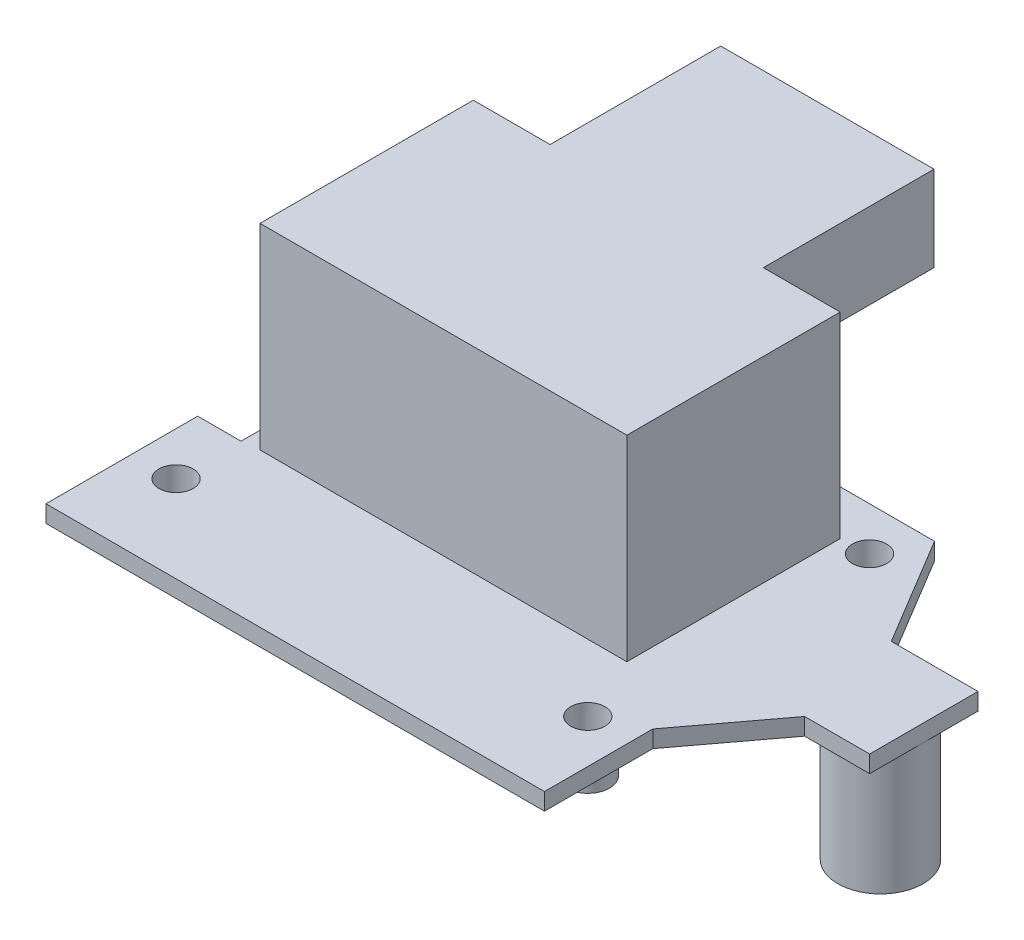
ISO-10303-21;
HEADER;
FILE_DESCRIPTION(('STEP AP214'),'2;1');
FILE_NAME('part.step','',(''),(''),'','','');
FILE_SCHEMA(('AUTOMOTIVE_DESIGN { 1 0 10303 214 1 1 1 1 }'));
ENDSEC;
DATA;
#1=APPLICATION_CONTEXT('core data for automotive mechanical design processes');
#2=APPLICATION_PROTOCOL_DEFINITION('international standard','automotive_design',2000,#1);
#3=PRODUCT_CONTEXT('',#1,'mechanical');
#4=PRODUCT('Part','Part','',(#3));
#5=PRODUCT_RELATED_PRODUCT_CATEGORY('part','',(#4));
#6=PRODUCT_DEFINITION_FORMATION('','',#4);
#7=PRODUCT_DEFINITION_CONTEXT('part definition',#1,'design');
#8=PRODUCT_DEFINITION('design','',#6,#7);
#9=PRODUCT_DEFINITION_SHAPE('','',#8);
#10=(LENGTH_UNIT() NAMED_UNIT(*) SI_UNIT(.MILLI.,.METRE.));
#11=(NAMED_UNIT(*) PLANE_ANGLE_UNIT() SI_UNIT($,.RADIAN.));
#12=(NAMED_UNIT(*) SI_UNIT($,.STERADIAN.) SOLID_ANGLE_UNIT());
#13=UNCERTAINTY_MEASURE_WITH_UNIT(LENGTH_MEASURE(1.E-05),#10,'distance_accuracy_value','');
#14=(GEOMETRIC_REPRESENTATION_CONTEXT(3) GLOBAL_UNCERTAINTY_ASSIGNED_CONTEXT((#13)) GLOBAL_UNIT_ASSIGNED_CONTEXT((#10,
#11,#12)) REPRESENTATION_CONTEXT('',''));
#15=CARTESIAN_POINT('',(0.,0.,0.));
#16=DIRECTION('',(0.,0.,1.));
#17=DIRECTION('',(1.,0.,0.));
#18=AXIS2_PLACEMENT_3D('',#15,#16,#17);
#19=CARTESIAN_POINT('',(7.08,25.,-43.));
#20=DIRECTION('',(0.,0.,-1.));
#21=DIRECTION('',(-1.,0.,0.));
#22=AXIS2_PLACEMENT_3D('',#19,#20,#21);
#23=PLANE('',#22);
#24=DIRECTION('',(1.,0.,0.));
#25=VECTOR('',#24,1.);
#26=CARTESIAN_POINT('',(7.08,25.,-43.));
#27=LINE('',#26,#25);
#28=CARTESIAN_POINT('',(7.08,25.,-43.));
#29=VERTEX_POINT('',#28);
#30=CARTESIAN_POINT('',(16.08,25.,-43.));
#31=VERTEX_POINT('',#30);
#32=EDGE_CURVE('E233',#29,#31,#27,.T.);
#33=ORIENTED_EDGE('',*,*,#32,.T.);
#34=DIRECTION('',(0.,1.,0.));
#35=VECTOR('',#34,1.);
#36=CARTESIAN_POINT('',(16.08,25.,-43.));
#37=LINE('',#36,#35);
#38=CARTESIAN_POINT('',(16.08,15.,-43.));
#39=VERTEX_POINT('',#38);
#40=EDGE_CURVE('E52',#39,#31,#37,.T.);
#41=ORIENTED_EDGE('',*,*,#40,.F.);
#42=DIRECTION('',(-1.,0.,0.));
#43=VECTOR('',#42,1.);
#44=CARTESIAN_POINT('',(16.08,15.,-43.));
#45=LINE('',#44,#43);
#46=CARTESIAN_POINT('',(41.08,15.,-43.));
#47=VERTEX_POINT('',#46);
#48=EDGE_CURVE('E47',#47,#39,#45,.T.);
#49=ORIENTED_EDGE('',*,*,#48,.F.);
#50=DIRECTION('',(0.,-1.,0.));
#51=VECTOR('',#50,1.);
#52=CARTESIAN_POINT('',(41.08,25.,-43.));
#53=LINE('',#52,#51);
#54=CARTESIAN_POINT('',(41.08,25.,-43.));
#55=VERTEX_POINT('',#54);
#56=EDGE_CURVE('E705',#55,#47,#53,.T.);
#57=ORIENTED_EDGE('',*,*,#56,.F.);
#58=CARTESIAN_POINT('',(50.08,25.,-43.));
#59=VERTEX_POINT('',#58);
#60=EDGE_CURVE('E232',#55,#59,#27,.T.);
#61=ORIENTED_EDGE('',*,*,#60,.T.);
#62=DIRECTION('',(0.,-1.,0.));
#63=VECTOR('',#62,1.);
#64=CARTESIAN_POINT('',(50.08,25.,-43.));
#65=LINE('',#64,#63);
#66=CARTESIAN_POINT('',(50.08,2.,-43.));
#67=VERTEX_POINT('',#66);
#68=EDGE_CURVE('E247',#59,#67,#65,.T.);
#69=ORIENTED_EDGE('',*,*,#68,.T.);
#70=DIRECTION('',(1.,0.,0.));
#71=VECTOR('',#70,1.);
#72=CARTESIAN_POINT('',(7.08,2.,-43.));
#73=LINE('',#72,#71);
#74=CARTESIAN_POINT('',(7.08,2.,-43.));
#75=VERTEX_POINT('',#74);
#76=EDGE_CURVE('E227',#75,#67,#73,.T.);
#77=ORIENTED_EDGE('',*,*,#76,.F.);
#78=DIRECTION('',(0.,-1.,0.));
#79=VECTOR('',#78,1.);
#80=CARTESIAN_POINT('',(7.08,25.,-43.));
#81=LINE('',#80,#79);
#82=EDGE_CURVE('E235',#29,#75,#81,.T.);
#83=ORIENTED_EDGE('',*,*,#82,.F.);
#84=EDGE_LOOP('',(#33,#41,#49,#57,#61,#69,#77,#83));
#85=FACE_BOUND('',#84,.T.);
#86=ADVANCED_FACE('F32',(#85),#23,.T.);
#87=CARTESIAN_POINT('',(0.,0.,0.));
#88=DIRECTION('',(0.,-1.,0.));
#89=DIRECTION('',(0.,0.,-1.));
#90=AXIS2_PLACEMENT_3D('',#87,#88,#89);
#91=PLANE('',#90);
#92=CARTESIAN_POINT('',(53.34,0.,-10.16));
#93=DIRECTION('',(0.,-1.,0.));
#94=DIRECTION('',(0.,0.,-1.));
#95=AXIS2_PLACEMENT_3D('',#92,#93,#94);
#96=CIRCLE('',#95,2.555);
#97=CARTESIAN_POINT('',(53.34,0.,-12.715));
#98=VERTEX_POINT('',#97);
#99=EDGE_CURVE('E202',#98,#98,#96,.T.);
#100=ORIENTED_EDGE('',*,*,#99,.F.);
#101=EDGE_LOOP('',(#100));
#102=FACE_BOUND('',#101,.T.);
#103=DIRECTION('',(0.,0.,1.));
#104=VECTOR('',#103,1.);
#105=CARTESIAN_POINT('',(0.,0.,0.));
#106=LINE('',#105,#104);
#107=CARTESIAN_POINT('',(0.,0.,-17.78));
#108=VERTEX_POINT('',#107);
#109=CARTESIAN_POINT('',(0.,0.,0.));
#110=VERTEX_POINT('',#109);
#111=EDGE_CURVE('E263',#108,#110,#106,.T.);
#112=ORIENTED_EDGE('',*,*,#111,.F.);
#113=DIRECTION('',(-1.,0.,0.));
#114=VECTOR('',#113,1.);
#115=CARTESIAN_POINT('',(0.,0.,-17.78));
#116=LINE('',#115,#114);
#117=CARTESIAN_POINT('',(5.08,0.,-17.78));
#118=VERTEX_POINT('',#117);
#119=EDGE_CURVE('E268',#118,#108,#116,.T.);
#120=ORIENTED_EDGE('',*,*,#119,.F.);
#121=DIRECTION('',(0.,0.,1.));
#122=VECTOR('',#121,1.);
#123=CARTESIAN_POINT('',(5.08,0.,-48.26));
#124=LINE('',#123,#122);
#125=CARTESIAN_POINT('',(5.08,0.,-48.26));
#126=VERTEX_POINT('',#125);
#127=EDGE_CURVE('E307',#126,#118,#124,.T.);
#128=ORIENTED_EDGE('',*,*,#127,.F.);
#129=DIRECTION('',(-1.,0.,0.));
#130=VECTOR('',#129,1.);
#131=CARTESIAN_POINT('',(5.08,0.,-48.26));
#132=LINE('',#131,#130);
#133=CARTESIAN_POINT('',(55.88,0.,-48.26));
#134=VERTEX_POINT('',#133);
#135=EDGE_CURVE('E305',#134,#126,#132,.T.);
#136=ORIENTED_EDGE('',*,*,#135,.F.);
#137=DIRECTION('',(-0.515038074910052,0.,-0.857167300702114));
#138=VECTOR('',#137,1.);
#139=CARTESIAN_POINT('',(55.88,0.,-48.26));
#140=LINE('',#139,#138);
#141=CARTESIAN_POINT('',(63.5077138894179,0.,-35.5653522766017));
#142=VERTEX_POINT('',#141);
#143=EDGE_CURVE('E303',#142,#134,#140,.T.);
#144=ORIENTED_EDGE('',*,*,#143,.F.);
#145=DIRECTION('',(-1.,0.,0.));
#146=VECTOR('',#145,1.);
#147=CARTESIAN_POINT('',(63.5077138894179,0.,-35.5653522766017));
#148=LINE('',#147,#146);
#149=CARTESIAN_POINT('',(73.6677138894179,0.,-35.5653522766017));
#150=VERTEX_POINT('',#149);
#151=EDGE_CURVE('E301',#150,#142,#148,.T.);
#152=ORIENTED_EDGE('',*,*,#151,.F.);
#153=DIRECTION('',(0.,0.,-1.));
#154=VECTOR('',#153,1.);
#155=CARTESIAN_POINT('',(73.6677138894179,0.,-35.5653522766017));
#156=LINE('',#155,#154);
#157=CARTESIAN_POINT('',(73.6677138894179,0.,-22.8653522766017));
#158=VERTEX_POINT('',#157);
#159=EDGE_CURVE('E299',#158,#150,#156,.T.);
#160=ORIENTED_EDGE('',*,*,#159,.F.);
#161=DIRECTION('',(1.,0.,0.));
#162=VECTOR('',#161,1.);
#163=CARTESIAN_POINT('',(66.0477138894179,0.,-22.8653522766017));
#164=LINE('',#163,#162);
#165=CARTESIAN_POINT('',(66.0477138894179,0.,-22.8653522766017));
#166=VERTEX_POINT('',#165);
#167=EDGE_CURVE('E297',#166,#158,#164,.T.);
#168=ORIENTED_EDGE('',*,*,#167,.F.);
#169=DIRECTION('',(0.600186293677371,0.,-0.799860245844123));
#170=VECTOR('',#169,1.);
#171=CARTESIAN_POINT('',(58.42,0.,-12.7));
#172=LINE('',#171,#170);
#173=CARTESIAN_POINT('',(58.42,0.,-12.7));
#174=VERTEX_POINT('',#173);
#175=EDGE_CURVE('E295',#174,#166,#172,.T.);
#176=ORIENTED_EDGE('',*,*,#175,.F.);
#177=DIRECTION('',(0.,0.,-1.));
#178=VECTOR('',#177,1.);
#179=CARTESIAN_POINT('',(58.42,0.,0.));
#180=LINE('',#179,#178);
#181=CARTESIAN_POINT('',(58.42,0.,0.));
#182=VERTEX_POINT('',#181);
#183=EDGE_CURVE('E293',#182,#174,#180,.T.);
#184=ORIENTED_EDGE('',*,*,#183,.F.);
#185=DIRECTION('',(1.,0.,0.));
#186=VECTOR('',#185,1.);
#187=CARTESIAN_POINT('',(0.,0.,0.));
#188=LINE('',#187,#186);
#189=EDGE_CURVE('E291',#110,#182,#188,.T.);
#190=ORIENTED_EDGE('',*,*,#189,.F.);
#191=EDGE_LOOP('',(#112,#120,#128,#136,#144,#152,#160,#168,#176,#184,#190));
#192=FACE_BOUND('',#191,.T.);
#193=CARTESIAN_POINT('',(68.5877138894179,0.,-29.2153522766017));
#194=DIRECTION('',(0.,-1.,0.));
#195=DIRECTION('',(0.,0.,-1.));
#196=AXIS2_PLACEMENT_3D('',#193,#194,#195);
#197=CIRCLE('',#196,5.);
#198=CARTESIAN_POINT('',(68.5877138894179,0.,-34.2153522766017));
#199=VERTEX_POINT('',#198);
#200=EDGE_CURVE('E215',#199,#199,#197,.T.);
#201=ORIENTED_EDGE('',*,*,#200,.F.);
#202=EDGE_LOOP('',(#201));
#203=FACE_BOUND('',#202,.T.);
#204=CARTESIAN_POINT('',(5.08,0.,-10.16));
#205=DIRECTION('',(0.,-1.,0.));
#206=DIRECTION('',(0.,0.,-1.));
#207=AXIS2_PLACEMENT_3D('',#204,#205,#206);
#208=CIRCLE('',#207,2.555);
#209=CARTESIAN_POINT('',(5.08,0.,-12.715));
#210=VERTEX_POINT('',#209);
#211=EDGE_CURVE('E211',#210,#210,#208,.T.);
#212=ORIENTED_EDGE('',*,*,#211,.F.);
#213=EDGE_LOOP('',(#212));
#214=FACE_BOUND('',#213,.T.);
#215=CARTESIAN_POINT('',(53.34,0.,-43.18));
#216=DIRECTION('',(0.,-1.,0.));
#217=DIRECTION('',(0.,0.,-1.));
#218=AXIS2_PLACEMENT_3D('',#215,#216,#217);
#219=CIRCLE('',#218,2.555);
#220=CARTESIAN_POINT('',(53.34,0.,-45.735));
#221=VERTEX_POINT('',#220);
#222=EDGE_CURVE('E188',#221,#221,#219,.T.);
#223=ORIENTED_EDGE('',*,*,#222,.F.);
#224=EDGE_LOOP('',(#223));
#225=FACE_BOUND('',#224,.T.);
#226=ADVANCED_FACE('F346',(#102,#192,#203,#214,#225),#91,.T.);
#227=CARTESIAN_POINT('',(0.,2.,0.));
#228=DIRECTION('',(0.,-1.,0.));
#229=DIRECTION('',(0.,0.,-1.));
#230=AXIS2_PLACEMENT_3D('',#227,#228,#229);
#231=PLANE('',#230);
#232=CARTESIAN_POINT('',(53.34,2.,-43.18));
#233=DIRECTION('',(0.,1.,0.));
#234=DIRECTION('',(0.,0.,1.));
#235=AXIS2_PLACEMENT_3D('',#232,#233,#234);
#236=CIRCLE('',#235,2.);
#237=CARTESIAN_POINT('',(53.34,2.,-41.18));
#238=VERTEX_POINT('',#237);
#239=EDGE_CURVE('E254',#238,#238,#236,.T.);
#240=ORIENTED_EDGE('',*,*,#239,.F.);
#241=EDGE_LOOP('',(#240));
#242=FACE_BOUND('',#241,.T.);
#243=CARTESIAN_POINT('',(53.34,2.,-10.16));
#244=DIRECTION('',(0.,1.,0.));
#245=DIRECTION('',(0.,0.,1.));
#246=AXIS2_PLACEMENT_3D('',#243,#244,#245);
#247=CIRCLE('',#246,2.);
#248=CARTESIAN_POINT('',(53.34,2.,-8.16));
#249=VERTEX_POINT('',#248);
#250=EDGE_CURVE('E257',#249,#249,#247,.T.);
#251=ORIENTED_EDGE('',*,*,#250,.F.);
#252=EDGE_LOOP('',(#251));
#253=FACE_BOUND('',#252,.T.);
#254=CARTESIAN_POINT('',(5.08,2.,-10.16));
#255=DIRECTION('',(0.,1.,0.));
#256=DIRECTION('',(0.,0.,1.));
#257=AXIS2_PLACEMENT_3D('',#254,#255,#256);
#258=CIRCLE('',#257,2.);
#259=CARTESIAN_POINT('',(5.08,2.,-8.16));
#260=VERTEX_POINT('',#259);
#261=EDGE_CURVE('E260',#260,#260,#258,.T.);
#262=ORIENTED_EDGE('',*,*,#261,.F.);
#263=EDGE_LOOP('',(#262));
#264=FACE_BOUND('',#263,.T.);
#265=DIRECTION('',(0.,0.,1.));
#266=VECTOR('',#265,1.);
#267=CARTESIAN_POINT('',(0.,2.,0.));
#268=LINE('',#267,#266);
#269=CARTESIAN_POINT('',(0.,2.,-17.78));
#270=VERTEX_POINT('',#269);
#271=CARTESIAN_POINT('',(0.,2.,0.));
#272=VERTEX_POINT('',#271);
#273=EDGE_CURVE('E264',#270,#272,#268,.T.);
#274=ORIENTED_EDGE('',*,*,#273,.T.);
#275=DIRECTION('',(1.,0.,0.));
#276=VECTOR('',#275,1.);
#277=CARTESIAN_POINT('',(0.,2.,0.));
#278=LINE('',#277,#276);
#279=CARTESIAN_POINT('',(58.42,2.,0.));
#280=VERTEX_POINT('',#279);
#281=EDGE_CURVE('E267',#272,#280,#278,.T.);
#282=ORIENTED_EDGE('',*,*,#281,.T.);
#283=DIRECTION('',(0.,0.,-1.));
#284=VECTOR('',#283,1.);
#285=CARTESIAN_POINT('',(58.42,2.,0.));
#286=LINE('',#285,#284);
#287=CARTESIAN_POINT('',(58.42,2.,-12.7));
#288=VERTEX_POINT('',#287);
#289=EDGE_CURVE('E270',#280,#288,#286,.T.);
#290=ORIENTED_EDGE('',*,*,#289,.T.);
#291=DIRECTION('',(0.600186293677371,0.,-0.799860245844123));
#292=VECTOR('',#291,1.);
#293=CARTESIAN_POINT('',(58.42,2.,-12.7));
#294=LINE('',#293,#292);
#295=CARTESIAN_POINT('',(66.0477138894179,2.,-22.8653522766017));
#296=VERTEX_POINT('',#295);
#297=EDGE_CURVE('E272',#288,#296,#294,.T.);
#298=ORIENTED_EDGE('',*,*,#297,.T.);
#299=DIRECTION('',(1.,0.,0.));
#300=VECTOR('',#299,1.);
#301=CARTESIAN_POINT('',(66.0477138894179,2.,-22.8653522766017));
#302=LINE('',#301,#300);
#303=CARTESIAN_POINT('',(73.6677138894179,2.,-22.8653522766017));
#304=VERTEX_POINT('',#303);
#305=EDGE_CURVE('E274',#296,#304,#302,.T.);
#306=ORIENTED_EDGE('',*,*,#305,.T.);
#307=DIRECTION('',(0.,0.,-1.));
#308=VECTOR('',#307,1.);
#309=CARTESIAN_POINT('',(73.6677138894179,2.,-35.5653522766017));
#310=LINE('',#309,#308);
#311=CARTESIAN_POINT('',(73.6677138894179,2.,-35.5653522766017));
#312=VERTEX_POINT('',#311);
#313=EDGE_CURVE('E276',#304,#312,#310,.T.);
#314=ORIENTED_EDGE('',*,*,#313,.T.);
#315=DIRECTION('',(-1.,0.,0.));
#316=VECTOR('',#315,1.);
#317=CARTESIAN_POINT('',(63.5077138894179,2.,-35.5653522766017));
#318=LINE('',#317,#316);
#319=CARTESIAN_POINT('',(63.5077138894179,2.,-35.5653522766017));
#320=VERTEX_POINT('',#319);
#321=EDGE_CURVE('E278',#312,#320,#318,.T.);
#322=ORIENTED_EDGE('',*,*,#321,.T.);
#323=DIRECTION('',(-0.515038074910052,0.,-0.857167300702114));
#324=VECTOR('',#323,1.);
#325=CARTESIAN_POINT('',(55.88,2.,-48.26));
#326=LINE('',#325,#324);
#327=CARTESIAN_POINT('',(55.88,2.,-48.26));
#328=VERTEX_POINT('',#327);
#329=EDGE_CURVE('E280',#320,#328,#326,.T.);
#330=ORIENTED_EDGE('',*,*,#329,.T.);
#331=DIRECTION('',(-1.,0.,0.));
#332=VECTOR('',#331,1.);
#333=CARTESIAN_POINT('',(5.08,2.,-48.26));
#334=LINE('',#333,#332);
#335=CARTESIAN_POINT('',(5.08,2.,-48.26));
#336=VERTEX_POINT('',#335);
#337=EDGE_CURVE('E282',#328,#336,#334,.T.);
#338=ORIENTED_EDGE('',*,*,#337,.T.);
#339=DIRECTION('',(0.,0.,1.));
#340=VECTOR('',#339,1.);
#341=CARTESIAN_POINT('',(5.08,2.,-48.26));
#342=LINE('',#341,#340);
#343=CARTESIAN_POINT('',(5.08,2.,-17.78));
#344=VERTEX_POINT('',#343);
#345=EDGE_CURVE('E284',#336,#344,#342,.T.);
#346=ORIENTED_EDGE('',*,*,#345,.T.);
#347=DIRECTION('',(-1.,0.,0.));
#348=VECTOR('',#347,1.);
#349=CARTESIAN_POINT('',(0.,2.,-17.78));
#350=LINE('',#349,#348);
#351=EDGE_CURVE('E286',#344,#270,#350,.T.);
#352=ORIENTED_EDGE('',*,*,#351,.T.);
#353=EDGE_LOOP('',(#274,#282,#290,#298,#306,#314,#322,#330,#338,#346,#352));
#354=FACE_BOUND('',#353,.T.);
#355=DIRECTION('',(0.,0.,1.));
#356=VECTOR('',#355,1.);
#357=CARTESIAN_POINT('',(7.08,2.,-43.));
#358=LINE('',#357,#356);
#359=CARTESIAN_POINT('',(7.08,2.,-18.));
#360=VERTEX_POINT('',#359);
#361=EDGE_CURVE('E221',#75,#360,#358,.T.);
#362=ORIENTED_EDGE('',*,*,#361,.F.);
#363=ORIENTED_EDGE('',*,*,#76,.T.);
#364=DIRECTION('',(0.,0.,1.));
#365=VECTOR('',#364,1.);
#366=CARTESIAN_POINT('',(50.08,2.,-43.));
#367=LINE('',#366,#365);
#368=CARTESIAN_POINT('',(50.08,2.,-18.));
#369=VERTEX_POINT('',#368);
#370=EDGE_CURVE('E241',#67,#369,#367,.T.);
#371=ORIENTED_EDGE('',*,*,#370,.T.);
#372=DIRECTION('',(1.,0.,0.));
#373=VECTOR('',#372,1.);
#374=CARTESIAN_POINT('',(7.08,2.,-18.));
#375=LINE('',#374,#373);
#376=EDGE_CURVE('E238',#360,#369,#375,.T.);
#377=ORIENTED_EDGE('',*,*,#376,.F.);
#378=EDGE_LOOP('',(#362,#363,#371,#377));
#379=FACE_BOUND('',#378,.T.);
#380=ADVANCED_FACE('F360',(#242,#253,#264,#354,#379),#231,.F.);
#381=CARTESIAN_POINT('',(0.,2.,0.));
#382=DIRECTION('',(1.,0.,0.));
#383=DIRECTION('',(0.,0.,-1.));
#384=AXIS2_PLACEMENT_3D('',#381,#382,#383);
#385=PLANE('',#384);
#386=ORIENTED_EDGE('',*,*,#111,.T.);
#387=DIRECTION('',(0.,-1.,0.));
#388=VECTOR('',#387,1.);
#389=CARTESIAN_POINT('',(0.,2.,0.));
#390=LINE('',#389,#388);
#391=EDGE_CURVE('E11',#272,#110,#390,.T.);
#392=ORIENTED_EDGE('',*,*,#391,.F.);
#393=ORIENTED_EDGE('',*,*,#273,.F.);
#394=DIRECTION('',(0.,-1.,0.));
#395=VECTOR('',#394,1.);
#396=CARTESIAN_POINT('',(0.,2.,-17.78));
#397=LINE('',#396,#395);
#398=EDGE_CURVE('E288',#270,#108,#397,.T.);
#399=ORIENTED_EDGE('',*,*,#398,.T.);
#400=EDGE_LOOP('',(#386,#392,#393,#399));
#401=FACE_BOUND('',#400,.T.);
#402=ADVANCED_FACE('F34',(#401),#385,.F.);
#403=CARTESIAN_POINT('',(0.,2.,0.));
#404=DIRECTION('',(0.,0.,-1.));
#405=DIRECTION('',(-1.,0.,0.));
#406=AXIS2_PLACEMENT_3D('',#403,#404,#405);
#407=PLANE('',#406);
#408=ORIENTED_EDGE('',*,*,#189,.T.);
#409=DIRECTION('',(0.,-1.,0.));
#410=VECTOR('',#409,1.);
#411=CARTESIAN_POINT('',(58.42,2.,0.));
#412=LINE('',#411,#410);
#413=EDGE_CURVE('E40',#280,#182,#412,.T.);
#414=ORIENTED_EDGE('',*,*,#413,.F.);
#415=ORIENTED_EDGE('',*,*,#281,.F.);
#416=ORIENTED_EDGE('',*,*,#391,.T.);
#417=EDGE_LOOP('',(#408,#414,#415,#416));
#418=FACE_BOUND('',#417,.T.);
#419=ADVANCED_FACE('F365',(#418),#407,.F.);
#420=CARTESIAN_POINT('',(58.42,2.,0.));
#421=DIRECTION('',(-1.,0.,0.));
#422=DIRECTION('',(0.,0.,1.));
#423=AXIS2_PLACEMENT_3D('',#420,#421,#422);
#424=PLANE('',#423);
#425=ORIENTED_EDGE('',*,*,#183,.T.);
#426=DIRECTION('',(0.,-1.,0.));
#427=VECTOR('',#426,1.);
#428=CARTESIAN_POINT('',(58.42,2.,-12.7));
#429=LINE('',#428,#427);
#430=EDGE_CURVE('E333',#288,#174,#429,.T.);
#431=ORIENTED_EDGE('',*,*,#430,.F.);
#432=ORIENTED_EDGE('',*,*,#289,.F.);
#433=ORIENTED_EDGE('',*,*,#413,.T.);
#434=EDGE_LOOP('',(#425,#431,#432,#433));
#435=FACE_BOUND('',#434,.T.);
#436=ADVANCED_FACE('F340',(#435),#424,.F.);
#437=CARTESIAN_POINT('',(58.42,2.,-12.7));
#438=DIRECTION('',(-0.799860245844123,0.,-0.600186293677371));
#439=DIRECTION('',(-0.600186293677371,0.,0.799860245844123));
#440=AXIS2_PLACEMENT_3D('',#437,#438,#439);
#441=PLANE('',#440);
#442=ORIENTED_EDGE('',*,*,#175,.T.);
#443=DIRECTION('',(0.,-1.,0.));
#444=VECTOR('',#443,1.);
#445=CARTESIAN_POINT('',(66.0477138894179,2.,-22.8653522766017));
#446=LINE('',#445,#444);
#447=EDGE_CURVE('E330',#296,#166,#446,.T.);
#448=ORIENTED_EDGE('',*,*,#447,.F.);
#449=ORIENTED_EDGE('',*,*,#297,.F.);
#450=ORIENTED_EDGE('',*,*,#430,.T.);
#451=EDGE_LOOP('',(#442,#448,#449,#450));
#452=FACE_BOUND('',#451,.T.);
#453=ADVANCED_FACE('F352',(#452),#441,.F.);
#454=CARTESIAN_POINT('',(66.0477138894179,2.,-22.8653522766017));
#455=DIRECTION('',(0.,0.,-1.));
#456=DIRECTION('',(-1.,0.,0.));
#457=AXIS2_PLACEMENT_3D('',#454,#455,#456);
#458=PLANE('',#457);
#459=ORIENTED_EDGE('',*,*,#167,.T.);
#460=DIRECTION('',(0.,-1.,0.));
#461=VECTOR('',#460,1.);
#462=CARTESIAN_POINT('',(73.6677138894179,2.,-22.8653522766017));
#463=LINE('',#462,#461);
#464=EDGE_CURVE('E327',#304,#158,#463,.T.);
#465=ORIENTED_EDGE('',*,*,#464,.F.);
#466=ORIENTED_EDGE('',*,*,#305,.F.);
#467=ORIENTED_EDGE('',*,*,#447,.T.);
#468=EDGE_LOOP('',(#459,#465,#466,#467));
#469=FACE_BOUND('',#468,.T.);
#470=ADVANCED_FACE('F356',(#469),#458,.F.);
#471=CARTESIAN_POINT('',(73.6677138894179,2.,-35.5653522766017));
#472=DIRECTION('',(-1.,0.,0.));
#473=DIRECTION('',(0.,0.,1.));
#474=AXIS2_PLACEMENT_3D('',#471,#472,#473);
#475=PLANE('',#474);
#476=ORIENTED_EDGE('',*,*,#159,.T.);
#477=DIRECTION('',(0.,-1.,0.));
#478=VECTOR('',#477,1.);
#479=CARTESIAN_POINT('',(73.6677138894179,2.,-35.5653522766017));
#480=LINE('',#479,#478);
#481=EDGE_CURVE('E324',#312,#150,#480,.T.);
#482=ORIENTED_EDGE('',*,*,#481,.F.);
#483=ORIENTED_EDGE('',*,*,#313,.F.);
#484=ORIENTED_EDGE('',*,*,#464,.T.);
#485=EDGE_LOOP('',(#476,#482,#483,#484));
#486=FACE_BOUND('',#485,.T.);
#487=ADVANCED_FACE('F393',(#486),#475,.F.);
#488=CARTESIAN_POINT('',(63.5077138894179,2.,-35.5653522766017));
#489=DIRECTION('',(0.,0.,1.));
#490=DIRECTION('',(1.,0.,0.));
#491=AXIS2_PLACEMENT_3D('',#488,#489,#490);
#492=PLANE('',#491);
#493=ORIENTED_EDGE('',*,*,#151,.T.);
#494=DIRECTION('',(0.,-1.,0.));
#495=VECTOR('',#494,1.);
#496=CARTESIAN_POINT('',(63.5077138894179,2.,-35.5653522766017));
#497=LINE('',#496,#495);
#498=EDGE_CURVE('E321',#320,#142,#497,.T.);
#499=ORIENTED_EDGE('',*,*,#498,.F.);
#500=ORIENTED_EDGE('',*,*,#321,.F.);
#501=ORIENTED_EDGE('',*,*,#481,.T.);
#502=EDGE_LOOP('',(#493,#499,#500,#501));
#503=FACE_BOUND('',#502,.T.);
#504=ADVANCED_FACE('F391',(#503),#492,.F.);
#505=CARTESIAN_POINT('',(55.88,2.,-48.26));
#506=DIRECTION('',(-0.857167300702114,0.,0.515038074910052));
#507=DIRECTION('',(0.515038074910052,0.,0.857167300702114));
#508=AXIS2_PLACEMENT_3D('',#505,#506,#507);
#509=PLANE('',#508);
#510=ORIENTED_EDGE('',*,*,#143,.T.);
#511=DIRECTION('',(0.,-1.,0.));
#512=VECTOR('',#511,1.);
#513=CARTESIAN_POINT('',(55.88,2.,-48.26));
#514=LINE('',#513,#512);
#515=EDGE_CURVE('E318',#328,#134,#514,.T.);
#516=ORIENTED_EDGE('',*,*,#515,.F.);
#517=ORIENTED_EDGE('',*,*,#329,.F.);
#518=ORIENTED_EDGE('',*,*,#498,.T.);
#519=EDGE_LOOP('',(#510,#516,#517,#518));
#520=FACE_BOUND('',#519,.T.);
#521=ADVANCED_FACE('F386',(#520),#509,.F.);
#522=CARTESIAN_POINT('',(5.08,2.,-48.26));
#523=DIRECTION('',(0.,0.,1.));
#524=DIRECTION('',(1.,0.,0.));
#525=AXIS2_PLACEMENT_3D('',#522,#523,#524);
#526=PLANE('',#525);
#527=ORIENTED_EDGE('',*,*,#135,.T.);
#528=DIRECTION('',(0.,-1.,0.));
#529=VECTOR('',#528,1.);
#530=CARTESIAN_POINT('',(5.08,2.,-48.26));
#531=LINE('',#530,#529);
#532=EDGE_CURVE('E315',#336,#126,#531,.T.);
#533=ORIENTED_EDGE('',*,*,#532,.F.);
#534=ORIENTED_EDGE('',*,*,#337,.F.);
#535=ORIENTED_EDGE('',*,*,#515,.T.);
#536=EDGE_LOOP('',(#527,#533,#534,#535));
#537=FACE_BOUND('',#536,.T.);
#538=ADVANCED_FACE('F381',(#537),#526,.F.);
#539=CARTESIAN_POINT('',(5.08,2.,-48.26));
#540=DIRECTION('',(1.,0.,0.));
#541=DIRECTION('',(0.,0.,-1.));
#542=AXIS2_PLACEMENT_3D('',#539,#540,#541);
#543=PLANE('',#542);
#544=ORIENTED_EDGE('',*,*,#127,.T.);
#545=DIRECTION('',(0.,-1.,0.));
#546=VECTOR('',#545,1.);
#547=CARTESIAN_POINT('',(5.08,2.,-17.78));
#548=LINE('',#547,#546);
#549=EDGE_CURVE('E312',#344,#118,#548,.T.);
#550=ORIENTED_EDGE('',*,*,#549,.F.);
#551=ORIENTED_EDGE('',*,*,#345,.F.);
#552=ORIENTED_EDGE('',*,*,#532,.T.);
#553=EDGE_LOOP('',(#544,#550,#551,#552));
#554=FACE_BOUND('',#553,.T.);
#555=ADVANCED_FACE('F377',(#554),#543,.F.);
#556=CARTESIAN_POINT('',(0.,2.,-17.78));
#557=DIRECTION('',(0.,0.,1.));
#558=DIRECTION('',(1.,0.,0.));
#559=AXIS2_PLACEMENT_3D('',#556,#557,#558);
#560=PLANE('',#559);
#561=ORIENTED_EDGE('',*,*,#119,.T.);
#562=ORIENTED_EDGE('',*,*,#398,.F.);
#563=ORIENTED_EDGE('',*,*,#351,.F.);
#564=ORIENTED_EDGE('',*,*,#549,.T.);
#565=EDGE_LOOP('',(#561,#562,#563,#564));
#566=FACE_BOUND('',#565,.T.);
#567=ADVANCED_FACE('F372',(#566),#560,.F.);
#568=CARTESIAN_POINT('',(5.08,2.,-10.16));
#569=DIRECTION('',(0.,-1.,0.));
#570=DIRECTION('',(0.,0.,-1.));
#571=AXIS2_PLACEMENT_3D('',#568,#569,#570);
#572=CYLINDRICAL_SURFACE('',#571,2.);
#573=ORIENTED_EDGE('',*,*,#261,.T.);
#574=EDGE_LOOP('',(#573));
#575=FACE_BOUND('',#574,.T.);
#576=CARTESIAN_POINT('',(5.08,-4.,-10.16));
#577=DIRECTION('',(0.,-1.,0.));
#578=DIRECTION('',(0.,0.,-1.));
#579=AXIS2_PLACEMENT_3D('',#576,#577,#578);
#580=CIRCLE('',#579,2.);
#581=CARTESIAN_POINT('',(5.08,-4.,-12.16));
#582=VERTEX_POINT('',#581);
#583=EDGE_CURVE('E206',#582,#582,#580,.T.);
#584=ORIENTED_EDGE('',*,*,#583,.T.);
#585=EDGE_LOOP('',(#584));
#586=FACE_BOUND('',#585,.T.);
#587=ADVANCED_FACE('F431',(#575,#586),#572,.F.);
#588=CARTESIAN_POINT('',(53.34,2.,-10.16));
#589=DIRECTION('',(0.,-1.,0.));
#590=DIRECTION('',(0.,0.,-1.));
#591=AXIS2_PLACEMENT_3D('',#588,#589,#590);
#592=CYLINDRICAL_SURFACE('',#591,2.);
#593=ORIENTED_EDGE('',*,*,#250,.T.);
#594=EDGE_LOOP('',(#593));
#595=FACE_BOUND('',#594,.T.);
#596=CARTESIAN_POINT('',(53.34,-4.,-10.16));
#597=DIRECTION('',(0.,-1.,0.));
#598=DIRECTION('',(0.,0.,-1.));
#599=AXIS2_PLACEMENT_3D('',#596,#597,#598);
#600=CIRCLE('',#599,2.);
#601=CARTESIAN_POINT('',(53.34,-4.,-12.16));
#602=VERTEX_POINT('',#601);
#603=EDGE_CURVE('E197',#602,#602,#600,.T.);
#604=ORIENTED_EDGE('',*,*,#603,.T.);
#605=EDGE_LOOP('',(#604));
#606=FACE_BOUND('',#605,.T.);
#607=ADVANCED_FACE('F427',(#595,#606),#592,.F.);
#608=CARTESIAN_POINT('',(53.34,2.,-43.18));
#609=DIRECTION('',(0.,-1.,0.));
#610=DIRECTION('',(0.,0.,-1.));
#611=AXIS2_PLACEMENT_3D('',#608,#609,#610);
#612=CYLINDRICAL_SURFACE('',#611,2.);
#613=ORIENTED_EDGE('',*,*,#239,.T.);
#614=EDGE_LOOP('',(#613));
#615=FACE_BOUND('',#614,.T.);
#616=CARTESIAN_POINT('',(53.34,-4.,-43.18));
#617=DIRECTION('',(0.,-1.,0.));
#618=DIRECTION('',(0.,0.,-1.));
#619=AXIS2_PLACEMENT_3D('',#616,#617,#618);
#620=CIRCLE('',#619,2.);
#621=CARTESIAN_POINT('',(53.34,-4.,-45.18));
#622=VERTEX_POINT('',#621);
#623=EDGE_CURVE('E185',#622,#622,#620,.T.);
#624=ORIENTED_EDGE('',*,*,#623,.T.);
#625=EDGE_LOOP('',(#624));
#626=FACE_BOUND('',#625,.T.);
#627=ADVANCED_FACE('F423',(#615,#626),#612,.F.);
#628=CARTESIAN_POINT('',(7.08,25.,-43.));
#629=DIRECTION('',(1.,0.,0.));
#630=DIRECTION('',(0.,0.,-1.));
#631=AXIS2_PLACEMENT_3D('',#628,#629,#630);
#632=PLANE('',#631);
#633=ORIENTED_EDGE('',*,*,#361,.T.);
#634=DIRECTION('',(0.,-1.,0.));
#635=VECTOR('',#634,1.);
#636=CARTESIAN_POINT('',(7.08,25.,-18.));
#637=LINE('',#636,#635);
#638=CARTESIAN_POINT('',(7.08,25.,-18.));
#639=VERTEX_POINT('',#638);
#640=EDGE_CURVE('E252',#639,#360,#637,.T.);
#641=ORIENTED_EDGE('',*,*,#640,.F.);
#642=DIRECTION('',(0.,0.,1.));
#643=VECTOR('',#642,1.);
#644=CARTESIAN_POINT('',(7.08,25.,-43.));
#645=LINE('',#644,#643);
#646=EDGE_CURVE('E224',#29,#639,#645,.T.);
#647=ORIENTED_EDGE('',*,*,#646,.F.);
#648=ORIENTED_EDGE('',*,*,#82,.T.);
#649=EDGE_LOOP('',(#633,#641,#647,#648));
#650=FACE_BOUND('',#649,.T.);
#651=ADVANCED_FACE('F419',(#650),#632,.F.);
#652=CARTESIAN_POINT('',(7.08,25.,-18.));
#653=DIRECTION('',(0.,0.,-1.));
#654=DIRECTION('',(-1.,0.,0.));
#655=AXIS2_PLACEMENT_3D('',#652,#653,#654);
#656=PLANE('',#655);
#657=ORIENTED_EDGE('',*,*,#376,.T.);
#658=DIRECTION('',(0.,-1.,0.));
#659=VECTOR('',#658,1.);
#660=CARTESIAN_POINT('',(50.08,25.,-18.));
#661=LINE('',#660,#659);
#662=CARTESIAN_POINT('',(50.08,25.,-18.));
#663=VERTEX_POINT('',#662);
#664=EDGE_CURVE('E250',#663,#369,#661,.T.);
#665=ORIENTED_EDGE('',*,*,#664,.F.);
#666=DIRECTION('',(1.,0.,0.));
#667=VECTOR('',#666,1.);
#668=CARTESIAN_POINT('',(7.08,25.,-18.));
#669=LINE('',#668,#667);
#670=EDGE_CURVE('E226',#639,#663,#669,.T.);
#671=ORIENTED_EDGE('',*,*,#670,.F.);
#672=ORIENTED_EDGE('',*,*,#640,.T.);
#673=EDGE_LOOP('',(#657,#665,#671,#672));
#674=FACE_BOUND('',#673,.T.);
#675=ADVANCED_FACE('F415',(#674),#656,.F.);
#676=CARTESIAN_POINT('',(50.08,25.,-43.));
#677=DIRECTION('',(1.,0.,0.));
#678=DIRECTION('',(0.,0.,-1.));
#679=AXIS2_PLACEMENT_3D('',#676,#677,#678);
#680=PLANE('',#679);
#681=ORIENTED_EDGE('',*,*,#370,.F.);
#682=ORIENTED_EDGE('',*,*,#68,.F.);
#683=DIRECTION('',(0.,0.,1.));
#684=VECTOR('',#683,1.);
#685=CARTESIAN_POINT('',(50.08,25.,-43.));
#686=LINE('',#685,#684);
#687=EDGE_CURVE('E229',#59,#663,#686,.T.);
#688=ORIENTED_EDGE('',*,*,#687,.T.);
#689=ORIENTED_EDGE('',*,*,#664,.T.);
#690=EDGE_LOOP('',(#681,#682,#688,#689));
#691=FACE_BOUND('',#690,.T.);
#692=ADVANCED_FACE('F412',(#691),#680,.T.);
#693=CARTESIAN_POINT('',(0.,25.,0.));
#694=DIRECTION('',(0.,1.,0.));
#695=DIRECTION('',(0.,0.,1.));
#696=AXIS2_PLACEMENT_3D('',#693,#694,#695);
#697=PLANE('',#696);
#698=ORIENTED_EDGE('',*,*,#646,.T.);
#699=ORIENTED_EDGE('',*,*,#670,.T.);
#700=ORIENTED_EDGE('',*,*,#687,.F.);
#701=ORIENTED_EDGE('',*,*,#60,.F.);
#702=DIRECTION('',(0.,0.,1.));
#703=VECTOR('',#702,1.);
#704=CARTESIAN_POINT('',(41.08,25.,-63.));
#705=LINE('',#704,#703);
#706=CARTESIAN_POINT('',(41.08,25.,-63.));
#707=VERTEX_POINT('',#706);
#708=EDGE_CURVE('E170',#707,#55,#705,.T.);
#709=ORIENTED_EDGE('',*,*,#708,.F.);
#710=DIRECTION('',(1.,0.,0.));
#711=VECTOR('',#710,1.);
#712=CARTESIAN_POINT('',(16.08,25.,-63.));
#713=LINE('',#712,#711);
#714=CARTESIAN_POINT('',(16.08,25.,-63.));
#715=VERTEX_POINT('',#714);
#716=EDGE_CURVE('E162',#715,#707,#713,.T.);
#717=ORIENTED_EDGE('',*,*,#716,.F.);
#718=DIRECTION('',(0.,0.,1.));
#719=VECTOR('',#718,1.);
#720=CARTESIAN_POINT('',(16.08,25.,-63.));
#721=LINE('',#720,#719);
#722=EDGE_CURVE('E168',#715,#31,#721,.T.);
#723=ORIENTED_EDGE('',*,*,#722,.T.);
#724=ORIENTED_EDGE('',*,*,#32,.F.);
#725=EDGE_LOOP('',(#698,#699,#700,#701,#709,#717,#723,#724));
#726=FACE_BOUND('',#725,.T.);
#727=ADVANCED_FACE('F165',(#726),#697,.T.);
#728=CARTESIAN_POINT('',(68.5877138894179,-14.39,-29.2153522766017));
#729=DIRECTION('',(0.,1.,0.));
#730=DIRECTION('',(0.,0.,1.));
#731=AXIS2_PLACEMENT_3D('',#728,#729,#730);
#732=CYLINDRICAL_SURFACE('',#731,5.);
#733=CARTESIAN_POINT('',(68.5877138894179,-14.39,-29.2153522766017));
#734=DIRECTION('',(0.,-1.,0.));
#735=DIRECTION('',(0.,0.,-1.));
#736=AXIS2_PLACEMENT_3D('',#733,#734,#735);
#737=CIRCLE('',#736,5.);
#738=CARTESIAN_POINT('',(68.5877138894179,-14.39,-34.2153522766017));
#739=VERTEX_POINT('',#738);
#740=EDGE_CURVE('E218',#739,#739,#737,.T.);
#741=ORIENTED_EDGE('',*,*,#740,.F.);
#742=EDGE_LOOP('',(#741));
#743=FACE_BOUND('',#742,.T.);
#744=ORIENTED_EDGE('',*,*,#200,.T.);
#745=EDGE_LOOP('',(#744));
#746=FACE_BOUND('',#745,.T.);
#747=ADVANCED_FACE('F496',(#743,#746),#732,.T.);
#748=CARTESIAN_POINT('',(68.5877138894179,-14.39,-29.2153522766017));
#749=DIRECTION('',(0.,-1.,0.));
#750=DIRECTION('',(0.,0.,-1.));
#751=AXIS2_PLACEMENT_3D('',#748,#749,#750);
#752=PLANE('',#751);
#753=ORIENTED_EDGE('',*,*,#740,.T.);
#754=EDGE_LOOP('',(#753));
#755=FACE_BOUND('',#754,.T.);
#756=ADVANCED_FACE('F502',(#755),#752,.T.);
#757=CARTESIAN_POINT('',(5.08,-4.,-10.16));
#758=DIRECTION('',(0.,-1.,0.));
#759=DIRECTION('',(0.,0.,-1.));
#760=AXIS2_PLACEMENT_3D('',#757,#758,#759);
#761=PLANE('',#760);
#762=CARTESIAN_POINT('',(5.08,-4.,-10.16));
#763=DIRECTION('',(0.,-1.,0.));
#764=DIRECTION('',(0.,0.,-1.));
#765=AXIS2_PLACEMENT_3D('',#762,#763,#764);
#766=CIRCLE('',#765,2.555);
#767=CARTESIAN_POINT('',(5.08,-4.,-12.715));
#768=VERTEX_POINT('',#767);
#769=EDGE_CURVE('E212',#768,#768,#766,.T.);
#770=ORIENTED_EDGE('',*,*,#769,.T.);
#771=EDGE_LOOP('',(#770));
#772=FACE_BOUND('',#771,.T.);
#773=ORIENTED_EDGE('',*,*,#583,.F.);
#774=EDGE_LOOP('',(#773));
#775=FACE_BOUND('',#774,.T.);
#776=ADVANCED_FACE('F509',(#772,#775),#761,.T.);
#777=CARTESIAN_POINT('',(5.08,-4.,-10.16));
#778=DIRECTION('',(0.,1.,0.));
#779=DIRECTION('',(0.,0.,1.));
#780=AXIS2_PLACEMENT_3D('',#777,#778,#779);
#781=CYLINDRICAL_SURFACE('',#780,2.555);
#782=ORIENTED_EDGE('',*,*,#769,.F.);
#783=EDGE_LOOP('',(#782));
#784=FACE_BOUND('',#783,.T.);
#785=ORIENTED_EDGE('',*,*,#211,.T.);
#786=EDGE_LOOP('',(#785));
#787=FACE_BOUND('',#786,.T.);
#788=ADVANCED_FACE('F516',(#784,#787),#781,.T.);
#789=CARTESIAN_POINT('',(53.34,-4.,-10.16));
#790=DIRECTION('',(0.,-1.,0.));
#791=DIRECTION('',(0.,0.,-1.));
#792=AXIS2_PLACEMENT_3D('',#789,#790,#791);
#793=PLANE('',#792);
#794=CARTESIAN_POINT('',(53.34,-4.,-10.16));
#795=DIRECTION('',(0.,-1.,0.));
#796=DIRECTION('',(0.,0.,-1.));
#797=AXIS2_PLACEMENT_3D('',#794,#795,#796);
#798=CIRCLE('',#797,2.555);
#799=CARTESIAN_POINT('',(53.34,-4.,-12.715));
#800=VERTEX_POINT('',#799);
#801=EDGE_CURVE('E203',#800,#800,#798,.T.);
#802=ORIENTED_EDGE('',*,*,#801,.T.);
#803=EDGE_LOOP('',(#802));
#804=FACE_BOUND('',#803,.T.);
#805=ORIENTED_EDGE('',*,*,#603,.F.);
#806=EDGE_LOOP('',(#805));
#807=FACE_BOUND('',#806,.T.);
#808=ADVANCED_FACE('F524',(#804,#807),#793,.T.);
#809=CARTESIAN_POINT('',(53.34,-4.,-10.16));
#810=DIRECTION('',(0.,1.,0.));
#811=DIRECTION('',(0.,0.,1.));
#812=AXIS2_PLACEMENT_3D('',#809,#810,#811);
#813=CYLINDRICAL_SURFACE('',#812,2.555);
#814=ORIENTED_EDGE('',*,*,#801,.F.);
#815=EDGE_LOOP('',(#814));
#816=FACE_BOUND('',#815,.T.);
#817=ORIENTED_EDGE('',*,*,#99,.T.);
#818=EDGE_LOOP('',(#817));
#819=FACE_BOUND('',#818,.T.);
#820=ADVANCED_FACE('F532',(#816,#819),#813,.T.);
#821=CARTESIAN_POINT('',(53.34,-4.,-43.18));
#822=DIRECTION('',(0.,-1.,0.));
#823=DIRECTION('',(0.,0.,-1.));
#824=AXIS2_PLACEMENT_3D('',#821,#822,#823);
#825=PLANE('',#824);
#826=CARTESIAN_POINT('',(53.34,-4.,-43.18));
#827=DIRECTION('',(0.,-1.,0.));
#828=DIRECTION('',(0.,0.,-1.));
#829=AXIS2_PLACEMENT_3D('',#826,#827,#828);
#830=CIRCLE('',#829,2.555);
#831=CARTESIAN_POINT('',(53.34,-4.,-45.735));
#832=VERTEX_POINT('',#831);
#833=EDGE_CURVE('E194',#832,#832,#830,.T.);
#834=ORIENTED_EDGE('',*,*,#833,.T.);
#835=EDGE_LOOP('',(#834));
#836=FACE_BOUND('',#835,.T.);
#837=ORIENTED_EDGE('',*,*,#623,.F.);
#838=EDGE_LOOP('',(#837));
#839=FACE_BOUND('',#838,.T.);
#840=ADVANCED_FACE('F540',(#836,#839),#825,.T.);
#841=CARTESIAN_POINT('',(53.34,-4.,-43.18));
#842=DIRECTION('',(0.,1.,0.));
#843=DIRECTION('',(0.,0.,1.));
#844=AXIS2_PLACEMENT_3D('',#841,#842,#843);
#845=CYLINDRICAL_SURFACE('',#844,2.555);
#846=ORIENTED_EDGE('',*,*,#833,.F.);
#847=EDGE_LOOP('',(#846));
#848=FACE_BOUND('',#847,.T.);
#849=ORIENTED_EDGE('',*,*,#222,.T.);
#850=EDGE_LOOP('',(#849));
#851=FACE_BOUND('',#850,.T.);
#852=ADVANCED_FACE('F548',(#848,#851),#845,.T.);
#853=CARTESIAN_POINT('',(16.08,25.,-63.));
#854=DIRECTION('',(1.,0.,0.));
#855=DIRECTION('',(0.,0.,-1.));
#856=AXIS2_PLACEMENT_3D('',#853,#854,#855);
#857=PLANE('',#856);
#858=ORIENTED_EDGE('',*,*,#40,.T.);
#859=ORIENTED_EDGE('',*,*,#722,.F.);
#860=DIRECTION('',(0.,1.,0.));
#861=VECTOR('',#860,1.);
#862=CARTESIAN_POINT('',(16.08,25.,-63.));
#863=LINE('',#862,#861);
#864=CARTESIAN_POINT('',(16.08,15.,-63.));
#865=VERTEX_POINT('',#864);
#866=EDGE_CURVE('E174',#865,#715,#863,.T.);
#867=ORIENTED_EDGE('',*,*,#866,.F.);
#868=DIRECTION('',(0.,0.,1.));
#869=VECTOR('',#868,1.);
#870=CARTESIAN_POINT('',(16.08,15.,-63.));
#871=LINE('',#870,#869);
#872=EDGE_CURVE('E703',#865,#39,#871,.T.);
#873=ORIENTED_EDGE('',*,*,#872,.T.);
#874=EDGE_LOOP('',(#858,#859,#867,#873));
#875=FACE_BOUND('',#874,.T.);
#876=ADVANCED_FACE('F184',(#875),#857,.F.);
#877=CARTESIAN_POINT('',(41.08,25.,-63.));
#878=DIRECTION('',(-1.,0.,0.));
#879=DIRECTION('',(0.,-1.,0.));
#880=AXIS2_PLACEMENT_3D('',#877,#878,#879);
#881=PLANE('',#880);
#882=ORIENTED_EDGE('',*,*,#56,.T.);
#883=DIRECTION('',(0.,0.,1.));
#884=VECTOR('',#883,1.);
#885=CARTESIAN_POINT('',(41.08,15.,-63.));
#886=LINE('',#885,#884);
#887=CARTESIAN_POINT('',(41.08,15.,-63.));
#888=VERTEX_POINT('',#887);
#889=EDGE_CURVE('E190',#888,#47,#886,.T.);
#890=ORIENTED_EDGE('',*,*,#889,.F.);
#891=DIRECTION('',(0.,-1.,0.));
#892=VECTOR('',#891,1.);
#893=CARTESIAN_POINT('',(41.08,25.,-63.));
#894=LINE('',#893,#892);
#895=EDGE_CURVE('E173',#707,#888,#894,.T.);
#896=ORIENTED_EDGE('',*,*,#895,.F.);
#897=ORIENTED_EDGE('',*,*,#708,.T.);
#898=EDGE_LOOP('',(#882,#890,#896,#897));
#899=FACE_BOUND('',#898,.T.);
#900=ADVANCED_FACE('F562',(#899),#881,.F.);
#901=CARTESIAN_POINT('',(16.08,15.,-63.));
#902=DIRECTION('',(0.,1.,0.));
#903=DIRECTION('',(-1.,0.,0.));
#904=AXIS2_PLACEMENT_3D('',#901,#902,#903);
#905=PLANE('',#904);
#906=ORIENTED_EDGE('',*,*,#48,.T.);
#907=ORIENTED_EDGE('',*,*,#872,.F.);
#908=DIRECTION('',(-1.,0.,0.));
#909=VECTOR('',#908,1.);
#910=CARTESIAN_POINT('',(16.08,15.,-63.));
#911=LINE('',#910,#909);
#912=EDGE_CURVE('E179',#888,#865,#911,.T.);
#913=ORIENTED_EDGE('',*,*,#912,.F.);
#914=ORIENTED_EDGE('',*,*,#889,.T.);
#915=EDGE_LOOP('',(#906,#907,#913,#914));
#916=FACE_BOUND('',#915,.T.);
#917=ADVANCED_FACE('F569',(#916),#905,.F.);
#918=CARTESIAN_POINT('',(0.,0.,-63.));
#919=DIRECTION('',(0.,0.,1.));
#920=DIRECTION('',(1.,0.,0.));
#921=AXIS2_PLACEMENT_3D('',#918,#919,#920);
#922=PLANE('',#921);
#923=ORIENTED_EDGE('',*,*,#866,.T.);
#924=ORIENTED_EDGE('',*,*,#716,.T.);
#925=ORIENTED_EDGE('',*,*,#895,.T.);
#926=ORIENTED_EDGE('',*,*,#912,.T.);
#927=EDGE_LOOP('',(#923,#924,#925,#926));
#928=FACE_BOUND('',#927,.T.);
#929=ADVANCED_FACE('F177',(#928),#922,.F.);
#930=CLOSED_SHELL('',(#86,#226,#380,#402,#419,#436,#453,#470,#487,#504,#521,#538,#555,#567,#587,
#607,#627,#651,#675,#692,#727,#747,#756,#776,#788,#808,#820,#840,#852,#876,#900,#917,#929));
#931=MANIFOLD_SOLID_BREP('B2',#930);
#932=ADVANCED_BREP_SHAPE_REPRESENTATION('',(#18,#931),#14);
#933=SHAPE_DEFINITION_REPRESENTATION(#9,#932);
ENDSEC;
END-ISO-10303-21;
